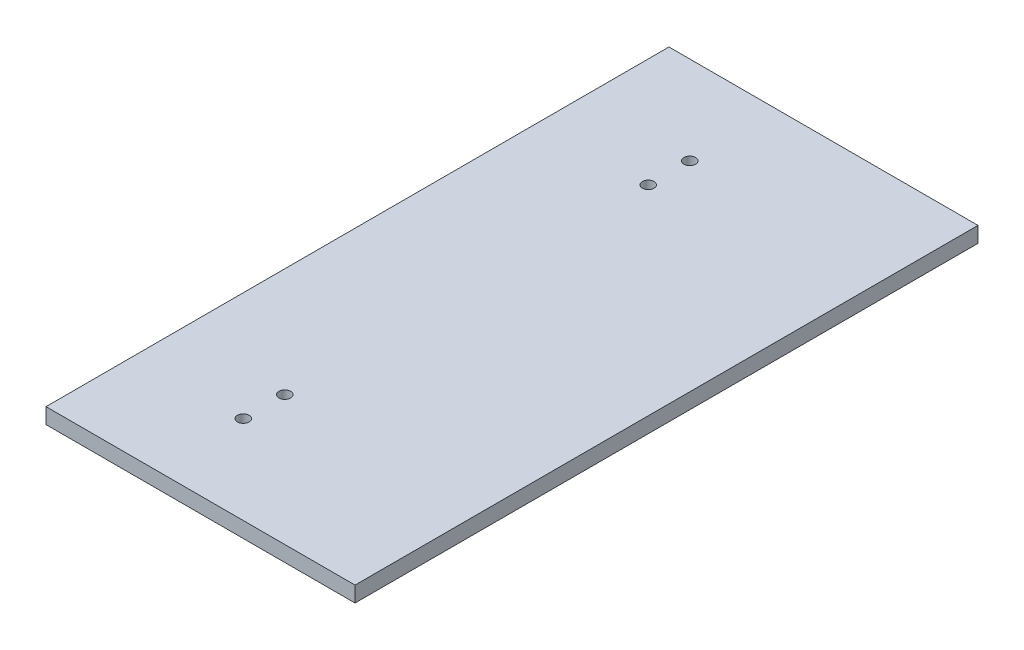
ISO-10303-21;
HEADER;
FILE_DESCRIPTION(('STEP AP214'),'2;1');
FILE_NAME('part.step','',(''),(''),'','','');
FILE_SCHEMA(('AUTOMOTIVE_DESIGN { 1 0 10303 214 1 1 1 1 }'));
ENDSEC;
DATA;
#1=APPLICATION_CONTEXT('core data for automotive mechanical design processes');
#2=APPLICATION_PROTOCOL_DEFINITION('international standard','automotive_design',2000,#1);
#3=PRODUCT_CONTEXT('',#1,'mechanical');
#4=PRODUCT('Part','Part','',(#3));
#5=PRODUCT_RELATED_PRODUCT_CATEGORY('part','',(#4));
#6=PRODUCT_DEFINITION_FORMATION('','',#4);
#7=PRODUCT_DEFINITION_CONTEXT('part definition',#1,'design');
#8=PRODUCT_DEFINITION('design','',#6,#7);
#9=PRODUCT_DEFINITION_SHAPE('','',#8);
#10=(LENGTH_UNIT() NAMED_UNIT(*) SI_UNIT(.MILLI.,.METRE.));
#11=(NAMED_UNIT(*) PLANE_ANGLE_UNIT() SI_UNIT($,.RADIAN.));
#12=(NAMED_UNIT(*) SI_UNIT($,.STERADIAN.) SOLID_ANGLE_UNIT());
#13=UNCERTAINTY_MEASURE_WITH_UNIT(LENGTH_MEASURE(1.E-05),#10,'distance_accuracy_value','');
#14=(GEOMETRIC_REPRESENTATION_CONTEXT(3) GLOBAL_UNCERTAINTY_ASSIGNED_CONTEXT((#13)) GLOBAL_UNIT_ASSIGNED_CONTEXT((#10,
#11,#12)) REPRESENTATION_CONTEXT('',''));
#15=CARTESIAN_POINT('',(0.,0.,0.));
#16=DIRECTION('',(0.,0.,1.));
#17=DIRECTION('',(1.,0.,0.));
#18=AXIS2_PLACEMENT_3D('',#15,#16,#17);
#19=CARTESIAN_POINT('',(0.,12.7,0.));
#20=DIRECTION('',(0.,1.,0.));
#21=DIRECTION('',(0.,0.,1.));
#22=AXIS2_PLACEMENT_3D('',#19,#20,#21);
#23=PLANE('',#22);
#24=CARTESIAN_POINT('',(-240.68006505503,12.7,183.840503750302));
#25=DIRECTION('',(0.,1.,0.));
#26=DIRECTION('',(0.,0.,1.));
#27=AXIS2_PLACEMENT_3D('',#24,#25,#26);
#28=CIRCLE('',#27,4.76250000000001);
#29=CARTESIAN_POINT('',(-240.68006505503,12.7,188.603003750302));
#30=VERTEX_POINT('',#29);
#31=EDGE_CURVE('E131',#30,#30,#28,.T.);
#32=ORIENTED_EDGE('',*,*,#31,.F.);
#33=EDGE_LOOP('',(#32));
#34=FACE_BOUND('',#33,.T.);
#35=CARTESIAN_POINT('',(-240.68006505503,12.7,-112.492829583031));
#36=DIRECTION('',(0.,1.,0.));
#37=DIRECTION('',(0.,0.,1.));
#38=AXIS2_PLACEMENT_3D('',#35,#36,#37);
#39=CIRCLE('',#38,4.76250000000001);
#40=CARTESIAN_POINT('',(-240.68006505503,12.7,-107.730329583031));
#41=VERTEX_POINT('',#40);
#42=EDGE_CURVE('E110',#41,#41,#39,.T.);
#43=ORIENTED_EDGE('',*,*,#42,.F.);
#44=EDGE_LOOP('',(#43));
#45=FACE_BOUND('',#44,.T.);
#46=DIRECTION('',(0.,0.,1.));
#47=VECTOR('',#46,1.);
#48=CARTESIAN_POINT('',(-329.58006505503,12.7,-218.326162916364));
#49=LINE('',#48,#47);
#50=CARTESIAN_POINT('',(-329.58006505503,12.7,-218.326162916364));
#51=VERTEX_POINT('',#50);
#52=CARTESIAN_POINT('',(-329.58006505503,12.7,289.673837083636));
#53=VERTEX_POINT('',#52);
#54=EDGE_CURVE('E95',#51,#53,#49,.T.);
#55=ORIENTED_EDGE('',*,*,#54,.T.);
#56=DIRECTION('',(1.,0.,0.));
#57=VECTOR('',#56,1.);
#58=CARTESIAN_POINT('',(-329.58006505503,12.7,289.673837083636));
#59=LINE('',#58,#57);
#60=CARTESIAN_POINT('',(-77.5800661350302,12.7,289.673837083636));
#61=VERTEX_POINT('',#60);
#62=EDGE_CURVE('E90',#53,#61,#59,.T.);
#63=ORIENTED_EDGE('',*,*,#62,.T.);
#64=DIRECTION('',(0.,0.,-1.));
#65=VECTOR('',#64,1.);
#66=CARTESIAN_POINT('',(-77.5800661350302,12.7,-218.326162916364));
#67=LINE('',#66,#65);
#68=CARTESIAN_POINT('',(-77.5800661350302,12.7,-218.326162916364));
#69=VERTEX_POINT('',#68);
#70=EDGE_CURVE('E93',#61,#69,#67,.T.);
#71=ORIENTED_EDGE('',*,*,#70,.T.);
#72=DIRECTION('',(-1.,0.,0.));
#73=VECTOR('',#72,1.);
#74=CARTESIAN_POINT('',(-329.58006505503,12.7,-218.326162916364));
#75=LINE('',#74,#73);
#76=EDGE_CURVE('E60',#69,#51,#75,.T.);
#77=ORIENTED_EDGE('',*,*,#76,.T.);
#78=EDGE_LOOP('',(#55,#63,#71,#77));
#79=FACE_BOUND('',#78,.T.);
#80=CARTESIAN_POINT('',(-240.68006505503,12.7,-146.359496249706));
#81=DIRECTION('',(0.,1.,0.));
#82=DIRECTION('',(0.,0.,1.));
#83=AXIS2_PLACEMENT_3D('',#80,#81,#82);
#84=CIRCLE('',#83,4.76250000000001);
#85=CARTESIAN_POINT('',(-240.68006505503,12.7,-141.596996249706));
#86=VERTEX_POINT('',#85);
#87=EDGE_CURVE('E125',#86,#86,#84,.T.);
#88=ORIENTED_EDGE('',*,*,#87,.F.);
#89=EDGE_LOOP('',(#88));
#90=FACE_BOUND('',#89,.T.);
#91=CARTESIAN_POINT('',(-240.68006505503,12.7,217.707170416969));
#92=DIRECTION('',(0.,1.,0.));
#93=DIRECTION('',(0.,0.,1.));
#94=AXIS2_PLACEMENT_3D('',#91,#92,#93);
#95=CIRCLE('',#94,4.76250000000001);
#96=CARTESIAN_POINT('',(-240.68006505503,12.7,222.469670416969));
#97=VERTEX_POINT('',#96);
#98=EDGE_CURVE('E137',#97,#97,#95,.T.);
#99=ORIENTED_EDGE('',*,*,#98,.F.);
#100=EDGE_LOOP('',(#99));
#101=FACE_BOUND('',#100,.T.);
#102=ADVANCED_FACE('F43',(#34,#45,#79,#90,#101),#23,.T.);
#103=CARTESIAN_POINT('',(0.,0.,0.));
#104=DIRECTION('',(0.,1.,0.));
#105=DIRECTION('',(0.,0.,1.));
#106=AXIS2_PLACEMENT_3D('',#103,#104,#105);
#107=PLANE('',#106);
#108=DIRECTION('',(0.,0.,1.));
#109=VECTOR('',#108,1.);
#110=CARTESIAN_POINT('',(-329.58006505503,0.,-218.326162916364));
#111=LINE('',#110,#109);
#112=CARTESIAN_POINT('',(-329.58006505503,0.,-218.326162916364));
#113=VERTEX_POINT('',#112);
#114=CARTESIAN_POINT('',(-329.58006505503,0.,289.673837083636));
#115=VERTEX_POINT('',#114);
#116=EDGE_CURVE('E107',#113,#115,#111,.T.);
#117=ORIENTED_EDGE('',*,*,#116,.F.);
#118=DIRECTION('',(-1.,0.,0.));
#119=VECTOR('',#118,1.);
#120=CARTESIAN_POINT('',(-329.58006505503,0.,-218.326162916364));
#121=LINE('',#120,#119);
#122=CARTESIAN_POINT('',(-77.5800661350302,0.,-218.326162916364));
#123=VERTEX_POINT('',#122);
#124=EDGE_CURVE('E83',#123,#113,#121,.T.);
#125=ORIENTED_EDGE('',*,*,#124,.F.);
#126=DIRECTION('',(0.,0.,-1.));
#127=VECTOR('',#126,1.);
#128=CARTESIAN_POINT('',(-77.5800661350302,0.,-218.326162916364));
#129=LINE('',#128,#127);
#130=CARTESIAN_POINT('',(-77.5800661350302,0.,289.673837083636));
#131=VERTEX_POINT('',#130);
#132=EDGE_CURVE('E77',#131,#123,#129,.T.);
#133=ORIENTED_EDGE('',*,*,#132,.F.);
#134=DIRECTION('',(1.,0.,0.));
#135=VECTOR('',#134,1.);
#136=CARTESIAN_POINT('',(-329.58006505503,0.,289.673837083636));
#137=LINE('',#136,#135);
#138=EDGE_CURVE('E99',#115,#131,#137,.T.);
#139=ORIENTED_EDGE('',*,*,#138,.F.);
#140=EDGE_LOOP('',(#117,#125,#133,#139));
#141=FACE_BOUND('',#140,.T.);
#142=CARTESIAN_POINT('',(-240.68006505503,0.,-112.492829583031));
#143=DIRECTION('',(0.,1.,0.));
#144=DIRECTION('',(0.,0.,1.));
#145=AXIS2_PLACEMENT_3D('',#142,#143,#144);
#146=CIRCLE('',#145,4.76250000000001);
#147=CARTESIAN_POINT('',(-240.68006505503,0.,-107.730329583031));
#148=VERTEX_POINT('',#147);
#149=EDGE_CURVE('E122',#148,#148,#146,.T.);
#150=ORIENTED_EDGE('',*,*,#149,.T.);
#151=EDGE_LOOP('',(#150));
#152=FACE_BOUND('',#151,.T.);
#153=CARTESIAN_POINT('',(-240.68006505503,0.,-146.359496249706));
#154=DIRECTION('',(0.,1.,0.));
#155=DIRECTION('',(0.,0.,1.));
#156=AXIS2_PLACEMENT_3D('',#153,#154,#155);
#157=CIRCLE('',#156,4.76250000000001);
#158=CARTESIAN_POINT('',(-240.68006505503,0.,-141.596996249706));
#159=VERTEX_POINT('',#158);
#160=EDGE_CURVE('E128',#159,#159,#157,.T.);
#161=ORIENTED_EDGE('',*,*,#160,.T.);
#162=EDGE_LOOP('',(#161));
#163=FACE_BOUND('',#162,.T.);
#164=CARTESIAN_POINT('',(-240.68006505503,0.,183.840503750302));
#165=DIRECTION('',(0.,1.,0.));
#166=DIRECTION('',(0.,0.,1.));
#167=AXIS2_PLACEMENT_3D('',#164,#165,#166);
#168=CIRCLE('',#167,4.76250000000001);
#169=CARTESIAN_POINT('',(-240.68006505503,0.,188.603003750302));
#170=VERTEX_POINT('',#169);
#171=EDGE_CURVE('E134',#170,#170,#168,.T.);
#172=ORIENTED_EDGE('',*,*,#171,.T.);
#173=EDGE_LOOP('',(#172));
#174=FACE_BOUND('',#173,.T.);
#175=CARTESIAN_POINT('',(-240.68006505503,0.,217.707170416969));
#176=DIRECTION('',(0.,1.,0.));
#177=DIRECTION('',(0.,0.,1.));
#178=AXIS2_PLACEMENT_3D('',#175,#176,#177);
#179=CIRCLE('',#178,4.76250000000001);
#180=CARTESIAN_POINT('',(-240.68006505503,0.,222.469670416969));
#181=VERTEX_POINT('',#180);
#182=EDGE_CURVE('E140',#181,#181,#179,.T.);
#183=ORIENTED_EDGE('',*,*,#182,.T.);
#184=EDGE_LOOP('',(#183));
#185=FACE_BOUND('',#184,.T.);
#186=ADVANCED_FACE('F118',(#141,#152,#163,#174,#185),#107,.F.);
#187=CARTESIAN_POINT('',(-329.58006505503,12.7,-218.326162916364));
#188=DIRECTION('',(1.,0.,0.));
#189=DIRECTION('',(0.,0.,-1.));
#190=AXIS2_PLACEMENT_3D('',#187,#188,#189);
#191=PLANE('',#190);
#192=ORIENTED_EDGE('',*,*,#116,.T.);
#193=DIRECTION('',(0.,-1.,0.));
#194=VECTOR('',#193,1.);
#195=CARTESIAN_POINT('',(-329.58006505503,12.7,289.673837083636));
#196=LINE('',#195,#194);
#197=EDGE_CURVE('E11',#53,#115,#196,.T.);
#198=ORIENTED_EDGE('',*,*,#197,.F.);
#199=ORIENTED_EDGE('',*,*,#54,.F.);
#200=DIRECTION('',(0.,-1.,0.));
#201=VECTOR('',#200,1.);
#202=CARTESIAN_POINT('',(-329.58006505503,12.7,-218.326162916364));
#203=LINE('',#202,#201);
#204=EDGE_CURVE('E103',#51,#113,#203,.T.);
#205=ORIENTED_EDGE('',*,*,#204,.T.);
#206=EDGE_LOOP('',(#192,#198,#199,#205));
#207=FACE_BOUND('',#206,.T.);
#208=ADVANCED_FACE('F45',(#207),#191,.F.);
#209=CARTESIAN_POINT('',(-329.58006505503,12.7,289.673837083636));
#210=DIRECTION('',(0.,0.,-1.));
#211=DIRECTION('',(-1.,0.,0.));
#212=AXIS2_PLACEMENT_3D('',#209,#210,#211);
#213=PLANE('',#212);
#214=ORIENTED_EDGE('',*,*,#138,.T.);
#215=DIRECTION('',(0.,-1.,0.));
#216=VECTOR('',#215,1.);
#217=CARTESIAN_POINT('',(-77.5800661350302,12.7,289.673837083636));
#218=LINE('',#217,#216);
#219=EDGE_CURVE('E52',#61,#131,#218,.T.);
#220=ORIENTED_EDGE('',*,*,#219,.F.);
#221=ORIENTED_EDGE('',*,*,#62,.F.);
#222=ORIENTED_EDGE('',*,*,#197,.T.);
#223=EDGE_LOOP('',(#214,#220,#221,#222));
#224=FACE_BOUND('',#223,.T.);
#225=ADVANCED_FACE('F98',(#224),#213,.F.);
#226=CARTESIAN_POINT('',(-77.5800661350302,12.7,-218.326162916364));
#227=DIRECTION('',(-1.,0.,0.));
#228=DIRECTION('',(0.,0.,1.));
#229=AXIS2_PLACEMENT_3D('',#226,#227,#228);
#230=PLANE('',#229);
#231=ORIENTED_EDGE('',*,*,#132,.T.);
#232=DIRECTION('',(0.,-1.,0.));
#233=VECTOR('',#232,1.);
#234=CARTESIAN_POINT('',(-77.5800661350302,12.7,-218.326162916364));
#235=LINE('',#234,#233);
#236=EDGE_CURVE('E100',#69,#123,#235,.T.);
#237=ORIENTED_EDGE('',*,*,#236,.F.);
#238=ORIENTED_EDGE('',*,*,#70,.F.);
#239=ORIENTED_EDGE('',*,*,#219,.T.);
#240=EDGE_LOOP('',(#231,#237,#238,#239));
#241=FACE_BOUND('',#240,.T.);
#242=ADVANCED_FACE('F101',(#241),#230,.F.);
#243=CARTESIAN_POINT('',(-329.58006505503,12.7,-218.326162916364));
#244=DIRECTION('',(0.,0.,1.));
#245=DIRECTION('',(1.,0.,0.));
#246=AXIS2_PLACEMENT_3D('',#243,#244,#245);
#247=PLANE('',#246);
#248=ORIENTED_EDGE('',*,*,#124,.T.);
#249=ORIENTED_EDGE('',*,*,#204,.F.);
#250=ORIENTED_EDGE('',*,*,#76,.F.);
#251=ORIENTED_EDGE('',*,*,#236,.T.);
#252=EDGE_LOOP('',(#248,#249,#250,#251));
#253=FACE_BOUND('',#252,.T.);
#254=ADVANCED_FACE('F115',(#253),#247,.F.);
#255=CARTESIAN_POINT('',(-240.68006505503,12.7,-112.492829583031));
#256=DIRECTION('',(0.,-1.,0.));
#257=DIRECTION('',(0.,0.,-1.));
#258=AXIS2_PLACEMENT_3D('',#255,#256,#257);
#259=CYLINDRICAL_SURFACE('',#258,4.76250000000001);
#260=ORIENTED_EDGE('',*,*,#42,.T.);
#261=EDGE_LOOP('',(#260));
#262=FACE_BOUND('',#261,.T.);
#263=ORIENTED_EDGE('',*,*,#149,.F.);
#264=EDGE_LOOP('',(#263));
#265=FACE_BOUND('',#264,.T.);
#266=ADVANCED_FACE('F159',(#262,#265),#259,.F.);
#267=CARTESIAN_POINT('',(-240.68006505503,12.7,-146.359496249706));
#268=DIRECTION('',(0.,-1.,0.));
#269=DIRECTION('',(0.,0.,-1.));
#270=AXIS2_PLACEMENT_3D('',#267,#268,#269);
#271=CYLINDRICAL_SURFACE('',#270,4.76250000000001);
#272=ORIENTED_EDGE('',*,*,#87,.T.);
#273=EDGE_LOOP('',(#272));
#274=FACE_BOUND('',#273,.T.);
#275=ORIENTED_EDGE('',*,*,#160,.F.);
#276=EDGE_LOOP('',(#275));
#277=FACE_BOUND('',#276,.T.);
#278=ADVANCED_FACE('F204',(#274,#277),#271,.F.);
#279=CARTESIAN_POINT('',(-240.68006505503,12.7,183.840503750302));
#280=DIRECTION('',(0.,-1.,0.));
#281=DIRECTION('',(0.,0.,-1.));
#282=AXIS2_PLACEMENT_3D('',#279,#280,#281);
#283=CYLINDRICAL_SURFACE('',#282,4.76250000000001);
#284=ORIENTED_EDGE('',*,*,#31,.T.);
#285=EDGE_LOOP('',(#284));
#286=FACE_BOUND('',#285,.T.);
#287=ORIENTED_EDGE('',*,*,#171,.F.);
#288=EDGE_LOOP('',(#287));
#289=FACE_BOUND('',#288,.T.);
#290=ADVANCED_FACE('F212',(#286,#289),#283,.F.);
#291=CARTESIAN_POINT('',(-240.68006505503,12.7,217.707170416969));
#292=DIRECTION('',(0.,-1.,0.));
#293=DIRECTION('',(0.,0.,-1.));
#294=AXIS2_PLACEMENT_3D('',#291,#292,#293);
#295=CYLINDRICAL_SURFACE('',#294,4.76250000000001);
#296=ORIENTED_EDGE('',*,*,#98,.T.);
#297=EDGE_LOOP('',(#296));
#298=FACE_BOUND('',#297,.T.);
#299=ORIENTED_EDGE('',*,*,#182,.F.);
#300=EDGE_LOOP('',(#299));
#301=FACE_BOUND('',#300,.T.);
#302=ADVANCED_FACE('F146',(#298,#301),#295,.F.);
#303=CLOSED_SHELL('',(#102,#186,#208,#225,#242,#254,#266,#278,#290,#302));
#304=MANIFOLD_SOLID_BREP('B2',#303);
#305=ADVANCED_BREP_SHAPE_REPRESENTATION('',(#18,#304),#14);
#306=SHAPE_DEFINITION_REPRESENTATION(#9,#305);
ENDSEC;
END-ISO-10303-21;
